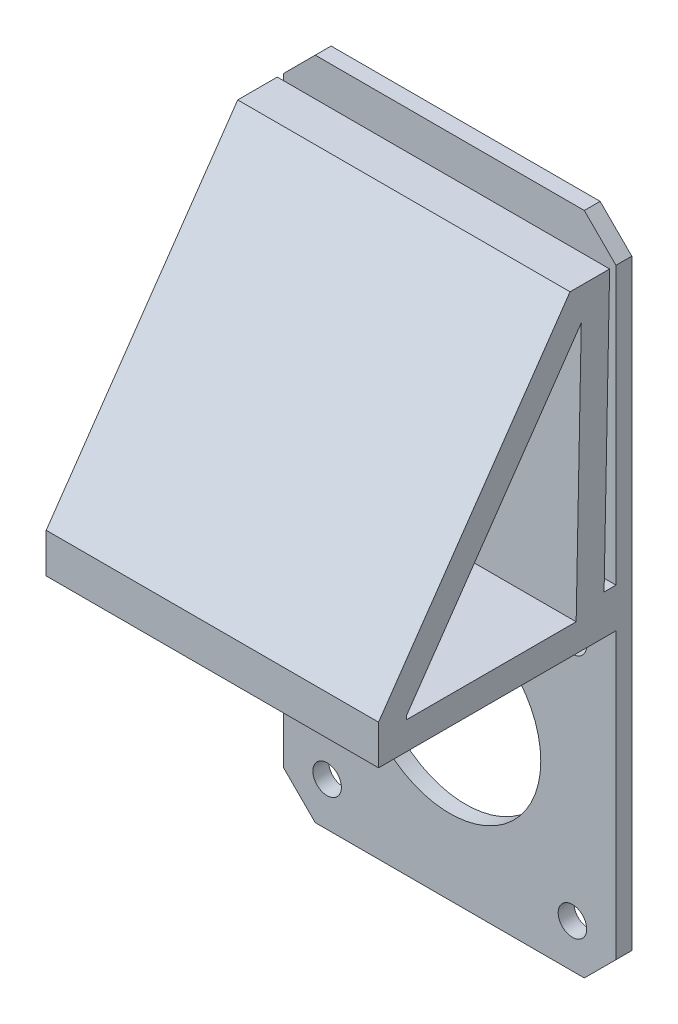
ISO-10303-21;
HEADER;
FILE_DESCRIPTION(('STEP AP214'),'2;1');
FILE_NAME('part.step','',(''),(''),'','','');
FILE_SCHEMA(('AUTOMOTIVE_DESIGN { 1 0 10303 214 1 1 1 1 }'));
ENDSEC;
DATA;
#1=APPLICATION_CONTEXT('core data for automotive mechanical design processes');
#2=APPLICATION_PROTOCOL_DEFINITION('international standard','automotive_design',2000,#1);
#3=PRODUCT_CONTEXT('',#1,'mechanical');
#4=PRODUCT('Part','Part','',(#3));
#5=PRODUCT_RELATED_PRODUCT_CATEGORY('part','',(#4));
#6=PRODUCT_DEFINITION_FORMATION('','',#4);
#7=PRODUCT_DEFINITION_CONTEXT('part definition',#1,'design');
#8=PRODUCT_DEFINITION('design','',#6,#7);
#9=PRODUCT_DEFINITION_SHAPE('','',#8);
#10=(LENGTH_UNIT() NAMED_UNIT(*) SI_UNIT(.MILLI.,.METRE.));
#11=(NAMED_UNIT(*) PLANE_ANGLE_UNIT() SI_UNIT($,.RADIAN.));
#12=(NAMED_UNIT(*) SI_UNIT($,.STERADIAN.) SOLID_ANGLE_UNIT());
#13=UNCERTAINTY_MEASURE_WITH_UNIT(LENGTH_MEASURE(1.E-05),#10,'distance_accuracy_value','');
#14=(GEOMETRIC_REPRESENTATION_CONTEXT(3) GLOBAL_UNCERTAINTY_ASSIGNED_CONTEXT((#13)) GLOBAL_UNIT_ASSIGNED_CONTEXT((#10,
#11,#12)) REPRESENTATION_CONTEXT('',''));
#15=CARTESIAN_POINT('',(0.,0.,0.));
#16=DIRECTION('',(0.,0.,1.));
#17=DIRECTION('',(1.,0.,0.));
#18=AXIS2_PLACEMENT_3D('',#15,#16,#17);
#19=CARTESIAN_POINT('',(0.,0.,2.));
#20=DIRECTION('',(0.,0.,-1.));
#21=DIRECTION('',(-1.,0.,0.));
#22=AXIS2_PLACEMENT_3D('',#19,#20,#21);
#23=PLANE('',#22);
#24=CARTESIAN_POINT('',(-15.5,15.5,2.));
#25=DIRECTION('',(0.,0.,1.));
#26=DIRECTION('',(1.,0.,0.));
#27=AXIS2_PLACEMENT_3D('',#24,#25,#26);
#28=CIRCLE('',#27,1.8);
#29=CARTESIAN_POINT('',(-13.7,15.5,2.));
#30=VERTEX_POINT('',#29);
#31=EDGE_CURVE('E237',#30,#30,#28,.T.);
#32=ORIENTED_EDGE('',*,*,#31,.F.);
#33=EDGE_LOOP('',(#32));
#34=FACE_BOUND('',#33,.T.);
#35=CARTESIAN_POINT('',(15.5,15.5,2.));
#36=DIRECTION('',(0.,0.,1.));
#37=DIRECTION('',(1.,0.,0.));
#38=AXIS2_PLACEMENT_3D('',#35,#36,#37);
#39=CIRCLE('',#38,1.8);
#40=CARTESIAN_POINT('',(17.3,15.5,2.));
#41=VERTEX_POINT('',#40);
#42=EDGE_CURVE('E255',#41,#41,#39,.T.);
#43=ORIENTED_EDGE('',*,*,#42,.F.);
#44=EDGE_LOOP('',(#43));
#45=FACE_BOUND('',#44,.T.);
#46=CARTESIAN_POINT('',(15.5,-15.5,2.));
#47=DIRECTION('',(0.,0.,1.));
#48=DIRECTION('',(1.,0.,0.));
#49=AXIS2_PLACEMENT_3D('',#46,#47,#48);
#50=CIRCLE('',#49,1.8);
#51=CARTESIAN_POINT('',(17.3,-15.5,2.));
#52=VERTEX_POINT('',#51);
#53=EDGE_CURVE('E261',#52,#52,#50,.T.);
#54=ORIENTED_EDGE('',*,*,#53,.F.);
#55=EDGE_LOOP('',(#54));
#56=FACE_BOUND('',#55,.T.);
#57=CARTESIAN_POINT('',(-15.5,-15.5,2.));
#58=DIRECTION('',(0.,0.,1.));
#59=DIRECTION('',(1.,0.,0.));
#60=AXIS2_PLACEMENT_3D('',#57,#58,#59);
#61=CIRCLE('',#60,1.8);
#62=CARTESIAN_POINT('',(-13.7,-15.5,2.));
#63=VERTEX_POINT('',#62);
#64=EDGE_CURVE('E267',#63,#63,#61,.T.);
#65=ORIENTED_EDGE('',*,*,#64,.F.);
#66=EDGE_LOOP('',(#65));
#67=FACE_BOUND('',#66,.T.);
#68=CARTESIAN_POINT('',(0.,0.,2.));
#69=DIRECTION('',(0.,0.,1.));
#70=DIRECTION('',(1.,0.,0.));
#71=AXIS2_PLACEMENT_3D('',#68,#69,#70);
#72=CIRCLE('',#71,11.5);
#73=CARTESIAN_POINT('',(11.5,0.,2.));
#74=VERTEX_POINT('',#73);
#75=EDGE_CURVE('E274',#74,#74,#72,.T.);
#76=ORIENTED_EDGE('',*,*,#75,.F.);
#77=EDGE_LOOP('',(#76));
#78=FACE_BOUND('',#77,.T.);
#79=DIRECTION('',(1.,0.,0.));
#80=VECTOR('',#79,1.);
#81=CARTESIAN_POINT('',(-21.,18.9999999999999,2.));
#82=LINE('',#81,#80);
#83=CARTESIAN_POINT('',(-21.,18.9999999999999,2.));
#84=VERTEX_POINT('',#83);
#85=CARTESIAN_POINT('',(21.,18.9999999999999,2.));
#86=VERTEX_POINT('',#85);
#87=EDGE_CURVE('E235',#84,#86,#82,.T.);
#88=ORIENTED_EDGE('',*,*,#87,.F.);
#89=DIRECTION('',(0.,-1.,0.));
#90=VECTOR('',#89,1.);
#91=CARTESIAN_POINT('',(-21.,-21.,2.));
#92=LINE('',#91,#90);
#93=CARTESIAN_POINT('',(-21.,-17.,2.));
#94=VERTEX_POINT('',#93);
#95=EDGE_CURVE('E284',#84,#94,#92,.T.);
#96=ORIENTED_EDGE('',*,*,#95,.T.);
#97=DIRECTION('',(-0.707106781186545,0.70710678118655,0.));
#98=VECTOR('',#97,1.);
#99=CARTESIAN_POINT('',(-17.,-21.,2.));
#100=LINE('',#99,#98);
#101=CARTESIAN_POINT('',(-17.,-21.,2.));
#102=VERTEX_POINT('',#101);
#103=EDGE_CURVE('E324',#94,#102,#100,.F.);
#104=ORIENTED_EDGE('',*,*,#103,.T.);
#105=DIRECTION('',(1.,0.,0.));
#106=VECTOR('',#105,1.);
#107=CARTESIAN_POINT('',(-21.,-21.,2.));
#108=LINE('',#107,#106);
#109=CARTESIAN_POINT('',(17.,-21.,2.));
#110=VERTEX_POINT('',#109);
#111=EDGE_CURVE('E283',#102,#110,#108,.T.);
#112=ORIENTED_EDGE('',*,*,#111,.T.);
#113=DIRECTION('',(-0.70710678118655,-0.707106781186545,0.));
#114=VECTOR('',#113,1.);
#115=CARTESIAN_POINT('',(21.,-17.,2.));
#116=LINE('',#115,#114);
#117=CARTESIAN_POINT('',(21.,-17.,2.));
#118=VERTEX_POINT('',#117);
#119=EDGE_CURVE('E326',#110,#118,#116,.F.);
#120=ORIENTED_EDGE('',*,*,#119,.T.);
#121=DIRECTION('',(0.,1.,0.));
#122=VECTOR('',#121,1.);
#123=CARTESIAN_POINT('',(21.,-21.,2.));
#124=LINE('',#123,#122);
#125=EDGE_CURVE('E288',#118,#86,#124,.T.);
#126=ORIENTED_EDGE('',*,*,#125,.T.);
#127=EDGE_LOOP('',(#88,#96,#104,#112,#120,#126));
#128=FACE_BOUND('',#127,.T.);
#129=ADVANCED_FACE('F33',(#34,#45,#56,#67,#78,#128),#23,.F.);
#130=CARTESIAN_POINT('',(-21.,59.,2.));
#131=VERTEX_POINT('',#130);
#132=CARTESIAN_POINT('',(-21.,23.9999999999999,2.));
#133=VERTEX_POINT('',#132);
#134=EDGE_CURVE('E280',#131,#133,#92,.T.);
#135=ORIENTED_EDGE('',*,*,#134,.T.);
#136=DIRECTION('',(1.,0.,0.));
#137=VECTOR('',#136,1.);
#138=CARTESIAN_POINT('',(-21.,23.9999999999999,2.));
#139=LINE('',#138,#137);
#140=CARTESIAN_POINT('',(21.,23.9999999999999,2.));
#141=VERTEX_POINT('',#140);
#142=EDGE_CURVE('E218',#133,#141,#139,.T.);
#143=ORIENTED_EDGE('',*,*,#142,.T.);
#144=CARTESIAN_POINT('',(21.,58.9999999999999,2.));
#145=VERTEX_POINT('',#144);
#146=EDGE_CURVE('E287',#141,#145,#124,.T.);
#147=ORIENTED_EDGE('',*,*,#146,.T.);
#148=DIRECTION('',(0.707106781186545,-0.70710678118655,0.));
#149=VECTOR('',#148,1.);
#150=CARTESIAN_POINT('',(17.,63.,2.));
#151=LINE('',#150,#149);
#152=CARTESIAN_POINT('',(17.,63.,2.));
#153=VERTEX_POINT('',#152);
#154=EDGE_CURVE('E328',#145,#153,#151,.F.);
#155=ORIENTED_EDGE('',*,*,#154,.T.);
#156=DIRECTION('',(-1.,0.,0.));
#157=VECTOR('',#156,1.);
#158=CARTESIAN_POINT('',(-21.,63.,2.));
#159=LINE('',#158,#157);
#160=CARTESIAN_POINT('',(-17.,63.,2.));
#161=VERTEX_POINT('',#160);
#162=EDGE_CURVE('E291',#153,#161,#159,.T.);
#163=ORIENTED_EDGE('',*,*,#162,.T.);
#164=DIRECTION('',(0.70710678118655,0.707106781186545,0.));
#165=VECTOR('',#164,1.);
#166=CARTESIAN_POINT('',(-21.,59.,2.));
#167=LINE('',#166,#165);
#168=EDGE_CURVE('E330',#161,#131,#167,.F.);
#169=ORIENTED_EDGE('',*,*,#168,.T.);
#170=EDGE_LOOP('',(#135,#143,#147,#155,#163,#169));
#171=FACE_BOUND('',#170,.T.);
#172=ADVANCED_FACE('F377',(#171),#23,.F.);
#173=CARTESIAN_POINT('',(0.,0.,0.));
#174=DIRECTION('',(0.,0.,-1.));
#175=DIRECTION('',(-1.,0.,0.));
#176=AXIS2_PLACEMENT_3D('',#173,#174,#175);
#177=PLANE('',#176);
#178=CARTESIAN_POINT('',(-15.5,15.5,0.));
#179=DIRECTION('',(0.,0.,1.));
#180=DIRECTION('',(1.,0.,0.));
#181=AXIS2_PLACEMENT_3D('',#178,#179,#180);
#182=CIRCLE('',#181,1.8);
#183=CARTESIAN_POINT('',(-13.7,15.5,0.));
#184=VERTEX_POINT('',#183);
#185=EDGE_CURVE('E252',#184,#184,#182,.T.);
#186=ORIENTED_EDGE('',*,*,#185,.T.);
#187=EDGE_LOOP('',(#186));
#188=FACE_BOUND('',#187,.T.);
#189=CARTESIAN_POINT('',(15.5,15.5,0.));
#190=DIRECTION('',(0.,0.,1.));
#191=DIRECTION('',(1.,0.,0.));
#192=AXIS2_PLACEMENT_3D('',#189,#190,#191);
#193=CIRCLE('',#192,1.8);
#194=CARTESIAN_POINT('',(17.3,15.5,0.));
#195=VERTEX_POINT('',#194);
#196=EDGE_CURVE('E258',#195,#195,#193,.T.);
#197=ORIENTED_EDGE('',*,*,#196,.T.);
#198=EDGE_LOOP('',(#197));
#199=FACE_BOUND('',#198,.T.);
#200=CARTESIAN_POINT('',(15.5,-15.5,0.));
#201=DIRECTION('',(0.,0.,1.));
#202=DIRECTION('',(1.,0.,0.));
#203=AXIS2_PLACEMENT_3D('',#200,#201,#202);
#204=CIRCLE('',#203,1.8);
#205=CARTESIAN_POINT('',(17.3,-15.5,0.));
#206=VERTEX_POINT('',#205);
#207=EDGE_CURVE('E264',#206,#206,#204,.T.);
#208=ORIENTED_EDGE('',*,*,#207,.T.);
#209=EDGE_LOOP('',(#208));
#210=FACE_BOUND('',#209,.T.);
#211=CARTESIAN_POINT('',(-15.5,-15.5,0.));
#212=DIRECTION('',(0.,0.,1.));
#213=DIRECTION('',(1.,0.,0.));
#214=AXIS2_PLACEMENT_3D('',#211,#212,#213);
#215=CIRCLE('',#214,1.8);
#216=CARTESIAN_POINT('',(-13.7,-15.5,0.));
#217=VERTEX_POINT('',#216);
#218=EDGE_CURVE('E270',#217,#217,#215,.T.);
#219=ORIENTED_EDGE('',*,*,#218,.T.);
#220=EDGE_LOOP('',(#219));
#221=FACE_BOUND('',#220,.T.);
#222=DIRECTION('',(0.,-1.,0.));
#223=VECTOR('',#222,1.);
#224=CARTESIAN_POINT('',(-21.,-21.,0.));
#225=LINE('',#224,#223);
#226=CARTESIAN_POINT('',(-21.,59.,0.));
#227=VERTEX_POINT('',#226);
#228=CARTESIAN_POINT('',(-21.,-17.,0.));
#229=VERTEX_POINT('',#228);
#230=EDGE_CURVE('E277',#227,#229,#225,.T.);
#231=ORIENTED_EDGE('',*,*,#230,.F.);
#232=DIRECTION('',(-0.70710678118655,-0.707106781186545,0.));
#233=VECTOR('',#232,1.);
#234=CARTESIAN_POINT('',(-39.9999999999999,40.0000000000002,0.));
#235=LINE('',#234,#233);
#236=CARTESIAN_POINT('',(-17.,63.,0.));
#237=VERTEX_POINT('',#236);
#238=EDGE_CURVE('E317',#227,#237,#235,.F.);
#239=ORIENTED_EDGE('',*,*,#238,.T.);
#240=DIRECTION('',(-1.,0.,0.));
#241=VECTOR('',#240,1.);
#242=CARTESIAN_POINT('',(-21.,63.,0.));
#243=LINE('',#242,#241);
#244=CARTESIAN_POINT('',(17.,63.,0.));
#245=VERTEX_POINT('',#244);
#246=EDGE_CURVE('E303',#245,#237,#243,.T.);
#247=ORIENTED_EDGE('',*,*,#246,.F.);
#248=DIRECTION('',(-0.707106781186545,0.70710678118655,0.));
#249=VECTOR('',#248,1.);
#250=CARTESIAN_POINT('',(40.0000000000001,39.9999999999998,0.));
#251=LINE('',#250,#249);
#252=CARTESIAN_POINT('',(21.,58.9999999999999,0.));
#253=VERTEX_POINT('',#252);
#254=EDGE_CURVE('E315',#245,#253,#251,.F.);
#255=ORIENTED_EDGE('',*,*,#254,.T.);
#256=DIRECTION('',(0.,1.,0.));
#257=VECTOR('',#256,1.);
#258=CARTESIAN_POINT('',(21.,-21.,0.));
#259=LINE('',#258,#257);
#260=CARTESIAN_POINT('',(21.,-17.,0.));
#261=VERTEX_POINT('',#260);
#262=EDGE_CURVE('E300',#261,#253,#259,.T.);
#263=ORIENTED_EDGE('',*,*,#262,.F.);
#264=DIRECTION('',(0.70710678118655,0.707106781186545,0.));
#265=VECTOR('',#264,1.);
#266=CARTESIAN_POINT('',(18.9999999999999,-19.0000000000001,0.));
#267=LINE('',#266,#265);
#268=CARTESIAN_POINT('',(17.,-21.,0.));
#269=VERTEX_POINT('',#268);
#270=EDGE_CURVE('E313',#261,#269,#267,.F.);
#271=ORIENTED_EDGE('',*,*,#270,.T.);
#272=DIRECTION('',(1.,0.,0.));
#273=VECTOR('',#272,1.);
#274=CARTESIAN_POINT('',(-21.,-21.,0.));
#275=LINE('',#274,#273);
#276=CARTESIAN_POINT('',(-17.,-21.,0.));
#277=VERTEX_POINT('',#276);
#278=EDGE_CURVE('E297',#277,#269,#275,.T.);
#279=ORIENTED_EDGE('',*,*,#278,.F.);
#280=DIRECTION('',(0.707106781186545,-0.70710678118655,0.));
#281=VECTOR('',#280,1.);
#282=CARTESIAN_POINT('',(-19.0000000000001,-18.9999999999999,0.));
#283=LINE('',#282,#281);
#284=EDGE_CURVE('E311',#277,#229,#283,.F.);
#285=ORIENTED_EDGE('',*,*,#284,.T.);
#286=EDGE_LOOP('',(#231,#239,#247,#255,#263,#271,#279,#285));
#287=FACE_BOUND('',#286,.T.);
#288=CARTESIAN_POINT('',(0.,0.,0.));
#289=DIRECTION('',(0.,0.,1.));
#290=DIRECTION('',(1.,0.,0.));
#291=AXIS2_PLACEMENT_3D('',#288,#289,#290);
#292=CIRCLE('',#291,11.5);
#293=CARTESIAN_POINT('',(11.5,0.,0.));
#294=VERTEX_POINT('',#293);
#295=EDGE_CURVE('E273',#294,#294,#292,.T.);
#296=ORIENTED_EDGE('',*,*,#295,.T.);
#297=EDGE_LOOP('',(#296));
#298=FACE_BOUND('',#297,.T.);
#299=ADVANCED_FACE('F348',(#188,#199,#210,#221,#287,#298),#177,.T.);
#300=CARTESIAN_POINT('',(-21.,-21.,2.));
#301=DIRECTION('',(1.,0.,0.));
#302=DIRECTION('',(0.,1.,0.));
#303=AXIS2_PLACEMENT_3D('',#300,#301,#302);
#304=PLANE('',#303);
#305=DIRECTION('',(0.,0.,1.));
#306=VECTOR('',#305,1.);
#307=CARTESIAN_POINT('',(-21.,22.4999999999999,7.03069993001399));
#308=LINE('',#307,#306);
#309=CARTESIAN_POINT('',(-21.,22.4999999999999,7.03069993001399));
#310=VERTEX_POINT('',#309);
#311=CARTESIAN_POINT('',(-21.,22.4999999999999,28.5));
#312=VERTEX_POINT('',#311);
#313=EDGE_CURVE('E190',#310,#312,#308,.T.);
#314=ORIENTED_EDGE('',*,*,#313,.F.);
#315=DIRECTION('',(0.,-0.999800059980007,0.0199960011995999));
#316=VECTOR('',#315,1.);
#317=CARTESIAN_POINT('',(-21.,54.8955254232018,6.38278942154996));
#318=LINE('',#317,#316);
#319=CARTESIAN_POINT('',(-21.,54.8955254232018,6.38278942154996));
#320=VERTEX_POINT('',#319);
#321=EDGE_CURVE('E48',#320,#310,#318,.T.);
#322=ORIENTED_EDGE('',*,*,#321,.F.);
#323=DIRECTION('',(0.,0.822530458866848,-0.568721060130792));
#324=VECTOR('',#323,1.);
#325=CARTESIAN_POINT('',(-21.,22.9078241733773,28.5));
#326=LINE('',#325,#324);
#327=CARTESIAN_POINT('',(-21.,22.9078241733773,28.5));
#328=VERTEX_POINT('',#327);
#329=EDGE_CURVE('E181',#328,#320,#326,.T.);
#330=ORIENTED_EDGE('',*,*,#329,.F.);
#331=DIRECTION('',(0.,1.,0.));
#332=VECTOR('',#331,1.);
#333=CARTESIAN_POINT('',(-21.,22.4999999999999,28.5));
#334=LINE('',#333,#332);
#335=EDGE_CURVE('E184',#312,#328,#334,.T.);
#336=ORIENTED_EDGE('',*,*,#335,.F.);
#337=EDGE_LOOP('',(#314,#322,#330,#336));
#338=FACE_BOUND('',#337,.T.);
#339=ORIENTED_EDGE('',*,*,#134,.F.);
#340=DIRECTION('',(0.,0.,-1.));
#341=VECTOR('',#340,1.);
#342=CARTESIAN_POINT('',(-21.,59.,2.));
#343=LINE('',#342,#341);
#344=EDGE_CURVE('E308',#131,#227,#343,.T.);
#345=ORIENTED_EDGE('',*,*,#344,.T.);
#346=ORIENTED_EDGE('',*,*,#230,.T.);
#347=DIRECTION('',(0.,0.,1.));
#348=VECTOR('',#347,1.);
#349=CARTESIAN_POINT('',(-21.,-17.,2.));
#350=LINE('',#349,#348);
#351=EDGE_CURVE('E294',#229,#94,#350,.T.);
#352=ORIENTED_EDGE('',*,*,#351,.T.);
#353=ORIENTED_EDGE('',*,*,#95,.F.);
#354=DIRECTION('',(0.,0.,-1.));
#355=VECTOR('',#354,1.);
#356=CARTESIAN_POINT('',(-21.,18.9999999999999,2.));
#357=LINE('',#356,#355);
#358=CARTESIAN_POINT('',(-21.,18.9999999999999,32.));
#359=VERTEX_POINT('',#358);
#360=EDGE_CURVE('E216',#359,#84,#357,.T.);
#361=ORIENTED_EDGE('',*,*,#360,.F.);
#362=DIRECTION('',(0.,-1.,0.));
#363=VECTOR('',#362,1.);
#364=CARTESIAN_POINT('',(-21.,23.9999999999999,32.));
#365=LINE('',#364,#363);
#366=CARTESIAN_POINT('',(-21.,23.9999999999999,32.));
#367=VERTEX_POINT('',#366);
#368=EDGE_CURVE('E213',#367,#359,#365,.T.);
#369=ORIENTED_EDGE('',*,*,#368,.F.);
#370=DIRECTION('',(0.,-0.822530458866848,0.568721060130792));
#371=VECTOR('',#370,1.);
#372=CARTESIAN_POINT('',(-21.,23.9999999999999,32.));
#373=LINE('',#372,#371);
#374=CARTESIAN_POINT('',(-21.,58.9999999999999,7.8));
#375=VERTEX_POINT('',#374);
#376=EDGE_CURVE('E210',#375,#367,#373,.T.);
#377=ORIENTED_EDGE('',*,*,#376,.F.);
#378=DIRECTION('',(0.,0.,1.));
#379=VECTOR('',#378,1.);
#380=CARTESIAN_POINT('',(-21.,58.9999999999999,7.8));
#381=LINE('',#380,#379);
#382=CARTESIAN_POINT('',(-21.,58.9999999999999,2.8));
#383=VERTEX_POINT('',#382);
#384=EDGE_CURVE('E207',#383,#375,#381,.T.);
#385=ORIENTED_EDGE('',*,*,#384,.F.);
#386=DIRECTION('',(0.,0.999800059980007,-0.0199960011996));
#387=VECTOR('',#386,1.);
#388=CARTESIAN_POINT('',(-21.,58.9999999999999,2.8));
#389=LINE('',#388,#387);
#390=CARTESIAN_POINT('',(-21.,23.9999999999999,3.5));
#391=VERTEX_POINT('',#390);
#392=EDGE_CURVE('E203',#391,#383,#389,.T.);
#393=ORIENTED_EDGE('',*,*,#392,.F.);
#394=DIRECTION('',(0.,0.,1.));
#395=VECTOR('',#394,1.);
#396=CARTESIAN_POINT('',(-21.,23.9999999999999,2.));
#397=LINE('',#396,#395);
#398=EDGE_CURVE('E200',#133,#391,#397,.T.);
#399=ORIENTED_EDGE('',*,*,#398,.F.);
#400=EDGE_LOOP('',(#339,#345,#346,#352,#353,#361,#369,#377,#385,#393,#399));
#401=FACE_BOUND('',#400,.T.);
#402=ADVANCED_FACE('F364',(#338,#401),#304,.F.);
#403=CARTESIAN_POINT('',(-21.,-21.,2.));
#404=DIRECTION('',(0.,1.,0.));
#405=DIRECTION('',(-1.,0.,0.));
#406=AXIS2_PLACEMENT_3D('',#403,#404,#405);
#407=PLANE('',#406);
#408=ORIENTED_EDGE('',*,*,#278,.T.);
#409=DIRECTION('',(0.,0.,1.));
#410=VECTOR('',#409,1.);
#411=CARTESIAN_POINT('',(17.,-21.,2.));
#412=LINE('',#411,#410);
#413=EDGE_CURVE('E11',#269,#110,#412,.T.);
#414=ORIENTED_EDGE('',*,*,#413,.T.);
#415=ORIENTED_EDGE('',*,*,#111,.F.);
#416=DIRECTION('',(0.,0.,-1.));
#417=VECTOR('',#416,1.);
#418=CARTESIAN_POINT('',(-17.,-21.,2.));
#419=LINE('',#418,#417);
#420=EDGE_CURVE('E41',#102,#277,#419,.T.);
#421=ORIENTED_EDGE('',*,*,#420,.T.);
#422=EDGE_LOOP('',(#408,#414,#415,#421));
#423=FACE_BOUND('',#422,.T.);
#424=ADVANCED_FACE('F342',(#423),#407,.F.);
#425=CARTESIAN_POINT('',(21.,-21.,2.));
#426=DIRECTION('',(-1.,0.,0.));
#427=DIRECTION('',(0.,0.,1.));
#428=AXIS2_PLACEMENT_3D('',#425,#426,#427);
#429=PLANE('',#428);
#430=DIRECTION('',(0.,0.822530458866848,-0.568721060130792));
#431=VECTOR('',#430,1.);
#432=CARTESIAN_POINT('',(21.,22.9078241733773,28.5));
#433=LINE('',#432,#431);
#434=CARTESIAN_POINT('',(21.,22.9078241733773,28.5));
#435=VERTEX_POINT('',#434);
#436=CARTESIAN_POINT('',(21.,54.8955254232018,6.38278942154996));
#437=VERTEX_POINT('',#436);
#438=EDGE_CURVE('E171',#435,#437,#433,.T.);
#439=ORIENTED_EDGE('',*,*,#438,.T.);
#440=DIRECTION('',(0.,-0.999800059980007,0.0199960011995999));
#441=VECTOR('',#440,1.);
#442=CARTESIAN_POINT('',(21.,54.8955254232018,6.38278942154996));
#443=LINE('',#442,#441);
#444=CARTESIAN_POINT('',(21.,22.4999999999999,7.03069993001399));
#445=VERTEX_POINT('',#444);
#446=EDGE_CURVE('E165',#437,#445,#443,.T.);
#447=ORIENTED_EDGE('',*,*,#446,.T.);
#448=DIRECTION('',(0.,0.,1.));
#449=VECTOR('',#448,1.);
#450=CARTESIAN_POINT('',(21.,22.4999999999999,7.03069993001399));
#451=LINE('',#450,#449);
#452=CARTESIAN_POINT('',(21.,22.4999999999999,28.5));
#453=VERTEX_POINT('',#452);
#454=EDGE_CURVE('E174',#445,#453,#451,.T.);
#455=ORIENTED_EDGE('',*,*,#454,.T.);
#456=DIRECTION('',(0.,1.,0.));
#457=VECTOR('',#456,1.);
#458=CARTESIAN_POINT('',(21.,22.4999999999999,28.5));
#459=LINE('',#458,#457);
#460=EDGE_CURVE('E56',#453,#435,#459,.T.);
#461=ORIENTED_EDGE('',*,*,#460,.T.);
#462=EDGE_LOOP('',(#439,#447,#455,#461));
#463=FACE_BOUND('',#462,.T.);
#464=ORIENTED_EDGE('',*,*,#262,.T.);
#465=DIRECTION('',(0.,0.,1.));
#466=VECTOR('',#465,1.);
#467=CARTESIAN_POINT('',(21.,59.,2.));
#468=LINE('',#467,#466);
#469=EDGE_CURVE('E335',#253,#145,#468,.T.);
#470=ORIENTED_EDGE('',*,*,#469,.T.);
#471=ORIENTED_EDGE('',*,*,#146,.F.);
#472=DIRECTION('',(0.,0.,1.));
#473=VECTOR('',#472,1.);
#474=CARTESIAN_POINT('',(21.,23.9999999999999,2.));
#475=LINE('',#474,#473);
#476=CARTESIAN_POINT('',(21.,23.9999999999999,3.5));
#477=VERTEX_POINT('',#476);
#478=EDGE_CURVE('E196',#141,#477,#475,.T.);
#479=ORIENTED_EDGE('',*,*,#478,.T.);
#480=DIRECTION('',(0.,0.999800059980007,-0.0199960011996));
#481=VECTOR('',#480,1.);
#482=CARTESIAN_POINT('',(21.,58.9999999999999,2.8));
#483=LINE('',#482,#481);
#484=CARTESIAN_POINT('',(21.,58.9999999999999,2.8));
#485=VERTEX_POINT('',#484);
#486=EDGE_CURVE('E221',#477,#485,#483,.T.);
#487=ORIENTED_EDGE('',*,*,#486,.T.);
#488=DIRECTION('',(0.,0.,1.));
#489=VECTOR('',#488,1.);
#490=CARTESIAN_POINT('',(21.,58.9999999999999,7.8));
#491=LINE('',#490,#489);
#492=CARTESIAN_POINT('',(21.,58.9999999999999,7.8));
#493=VERTEX_POINT('',#492);
#494=EDGE_CURVE('E224',#485,#493,#491,.T.);
#495=ORIENTED_EDGE('',*,*,#494,.T.);
#496=DIRECTION('',(0.,-0.822530458866848,0.568721060130792));
#497=VECTOR('',#496,1.);
#498=CARTESIAN_POINT('',(21.,23.9999999999999,32.));
#499=LINE('',#498,#497);
#500=CARTESIAN_POINT('',(21.,23.9999999999999,32.));
#501=VERTEX_POINT('',#500);
#502=EDGE_CURVE('E227',#493,#501,#499,.T.);
#503=ORIENTED_EDGE('',*,*,#502,.T.);
#504=DIRECTION('',(0.,-1.,0.));
#505=VECTOR('',#504,1.);
#506=CARTESIAN_POINT('',(21.,23.9999999999999,32.));
#507=LINE('',#506,#505);
#508=CARTESIAN_POINT('',(21.,18.9999999999999,32.));
#509=VERTEX_POINT('',#508);
#510=EDGE_CURVE('E230',#501,#509,#507,.T.);
#511=ORIENTED_EDGE('',*,*,#510,.T.);
#512=DIRECTION('',(0.,0.,-1.));
#513=VECTOR('',#512,1.);
#514=CARTESIAN_POINT('',(21.,18.9999999999999,2.));
#515=LINE('',#514,#513);
#516=EDGE_CURVE('E204',#509,#86,#515,.T.);
#517=ORIENTED_EDGE('',*,*,#516,.T.);
#518=ORIENTED_EDGE('',*,*,#125,.F.);
#519=DIRECTION('',(0.,0.,-1.));
#520=VECTOR('',#519,1.);
#521=CARTESIAN_POINT('',(21.,-17.,2.));
#522=LINE('',#521,#520);
#523=EDGE_CURVE('E332',#118,#261,#522,.T.);
#524=ORIENTED_EDGE('',*,*,#523,.T.);
#525=EDGE_LOOP('',(#464,#470,#471,#479,#487,#495,#503,#511,#517,#518,#524));
#526=FACE_BOUND('',#525,.T.);
#527=ADVANCED_FACE('F178',(#463,#526),#429,.F.);
#528=CARTESIAN_POINT('',(-21.,63.,2.));
#529=DIRECTION('',(0.,-1.,0.));
#530=DIRECTION('',(0.,0.,-1.));
#531=AXIS2_PLACEMENT_3D('',#528,#529,#530);
#532=PLANE('',#531);
#533=ORIENTED_EDGE('',*,*,#246,.T.);
#534=DIRECTION('',(0.,0.,1.));
#535=VECTOR('',#534,1.);
#536=CARTESIAN_POINT('',(-17.,63.,2.));
#537=LINE('',#536,#535);
#538=EDGE_CURVE('E322',#237,#161,#537,.T.);
#539=ORIENTED_EDGE('',*,*,#538,.T.);
#540=ORIENTED_EDGE('',*,*,#162,.F.);
#541=DIRECTION('',(0.,0.,-1.));
#542=VECTOR('',#541,1.);
#543=CARTESIAN_POINT('',(17.,63.,2.));
#544=LINE('',#543,#542);
#545=EDGE_CURVE('E319',#153,#245,#544,.T.);
#546=ORIENTED_EDGE('',*,*,#545,.T.);
#547=EDGE_LOOP('',(#533,#539,#540,#546));
#548=FACE_BOUND('',#547,.T.);
#549=ADVANCED_FACE('F371',(#548),#532,.F.);
#550=CARTESIAN_POINT('',(0.,0.,2.));
#551=DIRECTION('',(0.,0.,-1.));
#552=DIRECTION('',(-1.,0.,0.));
#553=AXIS2_PLACEMENT_3D('',#550,#551,#552);
#554=CYLINDRICAL_SURFACE('',#553,11.5);
#555=ORIENTED_EDGE('',*,*,#75,.T.);
#556=EDGE_LOOP('',(#555));
#557=FACE_BOUND('',#556,.T.);
#558=ORIENTED_EDGE('',*,*,#295,.F.);
#559=EDGE_LOOP('',(#558));
#560=FACE_BOUND('',#559,.T.);
#561=ADVANCED_FACE('F407',(#557,#560),#554,.F.);
#562=CARTESIAN_POINT('',(-15.5,-15.5,2.));
#563=DIRECTION('',(0.,0.,1.));
#564=DIRECTION('',(1.,0.,0.));
#565=AXIS2_PLACEMENT_3D('',#562,#563,#564);
#566=CYLINDRICAL_SURFACE('',#565,1.8);
#567=ORIENTED_EDGE('',*,*,#218,.F.);
#568=EDGE_LOOP('',(#567));
#569=FACE_BOUND('',#568,.T.);
#570=ORIENTED_EDGE('',*,*,#64,.T.);
#571=EDGE_LOOP('',(#570));
#572=FACE_BOUND('',#571,.T.);
#573=ADVANCED_FACE('F469',(#569,#572),#566,.F.);
#574=CARTESIAN_POINT('',(15.5,-15.5,2.));
#575=DIRECTION('',(0.,0.,1.));
#576=DIRECTION('',(1.,0.,0.));
#577=AXIS2_PLACEMENT_3D('',#574,#575,#576);
#578=CYLINDRICAL_SURFACE('',#577,1.8);
#579=ORIENTED_EDGE('',*,*,#207,.F.);
#580=EDGE_LOOP('',(#579));
#581=FACE_BOUND('',#580,.T.);
#582=ORIENTED_EDGE('',*,*,#53,.T.);
#583=EDGE_LOOP('',(#582));
#584=FACE_BOUND('',#583,.T.);
#585=ADVANCED_FACE('F466',(#581,#584),#578,.F.);
#586=CARTESIAN_POINT('',(15.5,15.5,2.));
#587=DIRECTION('',(0.,0.,1.));
#588=DIRECTION('',(1.,0.,0.));
#589=AXIS2_PLACEMENT_3D('',#586,#587,#588);
#590=CYLINDRICAL_SURFACE('',#589,1.8);
#591=ORIENTED_EDGE('',*,*,#196,.F.);
#592=EDGE_LOOP('',(#591));
#593=FACE_BOUND('',#592,.T.);
#594=ORIENTED_EDGE('',*,*,#42,.T.);
#595=EDGE_LOOP('',(#594));
#596=FACE_BOUND('',#595,.T.);
#597=ADVANCED_FACE('F462',(#593,#596),#590,.F.);
#598=CARTESIAN_POINT('',(-15.5,15.5,2.));
#599=DIRECTION('',(0.,0.,1.));
#600=DIRECTION('',(1.,0.,0.));
#601=AXIS2_PLACEMENT_3D('',#598,#599,#600);
#602=CYLINDRICAL_SURFACE('',#601,1.8);
#603=ORIENTED_EDGE('',*,*,#185,.F.);
#604=EDGE_LOOP('',(#603));
#605=FACE_BOUND('',#604,.T.);
#606=ORIENTED_EDGE('',*,*,#31,.T.);
#607=EDGE_LOOP('',(#606));
#608=FACE_BOUND('',#607,.T.);
#609=ADVANCED_FACE('F394',(#605,#608),#602,.F.);
#610=CARTESIAN_POINT('',(-21.,59.,2.));
#611=DIRECTION('',(0.707106781186545,-0.70710678118655,0.));
#612=DIRECTION('',(0.,0.,-1.));
#613=AXIS2_PLACEMENT_3D('',#610,#611,#612);
#614=PLANE('',#613);
#615=ORIENTED_EDGE('',*,*,#168,.F.);
#616=ORIENTED_EDGE('',*,*,#538,.F.);
#617=ORIENTED_EDGE('',*,*,#238,.F.);
#618=ORIENTED_EDGE('',*,*,#344,.F.);
#619=EDGE_LOOP('',(#615,#616,#617,#618));
#620=FACE_BOUND('',#619,.T.);
#621=ADVANCED_FACE('F375',(#620),#614,.F.);
#622=CARTESIAN_POINT('',(17.,63.,2.));
#623=DIRECTION('',(-0.70710678118655,-0.707106781186545,0.));
#624=DIRECTION('',(0.,0.,-1.));
#625=AXIS2_PLACEMENT_3D('',#622,#623,#624);
#626=PLANE('',#625);
#627=ORIENTED_EDGE('',*,*,#154,.F.);
#628=ORIENTED_EDGE('',*,*,#469,.F.);
#629=ORIENTED_EDGE('',*,*,#254,.F.);
#630=ORIENTED_EDGE('',*,*,#545,.F.);
#631=EDGE_LOOP('',(#627,#628,#629,#630));
#632=FACE_BOUND('',#631,.T.);
#633=ADVANCED_FACE('F387',(#632),#626,.F.);
#634=CARTESIAN_POINT('',(21.,-17.,2.));
#635=DIRECTION('',(-0.707106781186545,0.70710678118655,0.));
#636=DIRECTION('',(0.,0.,-1.));
#637=AXIS2_PLACEMENT_3D('',#634,#635,#636);
#638=PLANE('',#637);
#639=ORIENTED_EDGE('',*,*,#119,.F.);
#640=ORIENTED_EDGE('',*,*,#413,.F.);
#641=ORIENTED_EDGE('',*,*,#270,.F.);
#642=ORIENTED_EDGE('',*,*,#523,.F.);
#643=EDGE_LOOP('',(#639,#640,#641,#642));
#644=FACE_BOUND('',#643,.T.);
#645=ADVANCED_FACE('F354',(#644),#638,.F.);
#646=CARTESIAN_POINT('',(-17.,-21.,2.));
#647=DIRECTION('',(0.70710678118655,0.707106781186545,0.));
#648=DIRECTION('',(0.,0.,-1.));
#649=AXIS2_PLACEMENT_3D('',#646,#647,#648);
#650=PLANE('',#649);
#651=ORIENTED_EDGE('',*,*,#103,.F.);
#652=ORIENTED_EDGE('',*,*,#351,.F.);
#653=ORIENTED_EDGE('',*,*,#284,.F.);
#654=ORIENTED_EDGE('',*,*,#420,.F.);
#655=EDGE_LOOP('',(#651,#652,#653,#654));
#656=FACE_BOUND('',#655,.T.);
#657=ADVANCED_FACE('F35',(#656),#650,.F.);
#658=CARTESIAN_POINT('',(-21.,18.9999999999999,2.));
#659=DIRECTION('',(0.,-1.,0.));
#660=DIRECTION('',(0.,0.,-1.));
#661=AXIS2_PLACEMENT_3D('',#658,#659,#660);
#662=PLANE('',#661);
#663=ORIENTED_EDGE('',*,*,#516,.F.);
#664=DIRECTION('',(1.,0.,0.));
#665=VECTOR('',#664,1.);
#666=CARTESIAN_POINT('',(-21.,18.9999999999999,32.));
#667=LINE('',#666,#665);
#668=EDGE_CURVE('E238',#359,#509,#667,.T.);
#669=ORIENTED_EDGE('',*,*,#668,.F.);
#670=ORIENTED_EDGE('',*,*,#360,.T.);
#671=ORIENTED_EDGE('',*,*,#87,.T.);
#672=EDGE_LOOP('',(#663,#669,#670,#671));
#673=FACE_BOUND('',#672,.T.);
#674=ADVANCED_FACE('F438',(#673),#662,.T.);
#675=CARTESIAN_POINT('',(-21.,23.9999999999999,32.));
#676=DIRECTION('',(0.,0.,1.));
#677=DIRECTION('',(1.,0.,0.));
#678=AXIS2_PLACEMENT_3D('',#675,#676,#677);
#679=PLANE('',#678);
#680=ORIENTED_EDGE('',*,*,#510,.F.);
#681=DIRECTION('',(1.,0.,0.));
#682=VECTOR('',#681,1.);
#683=CARTESIAN_POINT('',(-21.,23.9999999999999,32.));
#684=LINE('',#683,#682);
#685=EDGE_CURVE('E240',#367,#501,#684,.T.);
#686=ORIENTED_EDGE('',*,*,#685,.F.);
#687=ORIENTED_EDGE('',*,*,#368,.T.);
#688=ORIENTED_EDGE('',*,*,#668,.T.);
#689=EDGE_LOOP('',(#680,#686,#687,#688));
#690=FACE_BOUND('',#689,.T.);
#691=ADVANCED_FACE('F441',(#690),#679,.T.);
#692=CARTESIAN_POINT('',(-21.,23.9999999999999,32.));
#693=DIRECTION('',(0.,0.568721060130792,0.822530458866848));
#694=DIRECTION('',(0.,-0.822530458866848,0.568721060130792));
#695=AXIS2_PLACEMENT_3D('',#692,#693,#694);
#696=PLANE('',#695);
#697=ORIENTED_EDGE('',*,*,#502,.F.);
#698=DIRECTION('',(1.,0.,0.));
#699=VECTOR('',#698,1.);
#700=CARTESIAN_POINT('',(-21.,58.9999999999999,7.8));
#701=LINE('',#700,#699);
#702=EDGE_CURVE('E242',#375,#493,#701,.T.);
#703=ORIENTED_EDGE('',*,*,#702,.F.);
#704=ORIENTED_EDGE('',*,*,#376,.T.);
#705=ORIENTED_EDGE('',*,*,#685,.T.);
#706=EDGE_LOOP('',(#697,#703,#704,#705));
#707=FACE_BOUND('',#706,.T.);
#708=ADVANCED_FACE('F445',(#707),#696,.T.);
#709=CARTESIAN_POINT('',(-21.,58.9999999999999,7.8));
#710=DIRECTION('',(0.,1.,0.));
#711=DIRECTION('',(0.,0.,1.));
#712=AXIS2_PLACEMENT_3D('',#709,#710,#711);
#713=PLANE('',#712);
#714=ORIENTED_EDGE('',*,*,#494,.F.);
#715=DIRECTION('',(1.,0.,0.));
#716=VECTOR('',#715,1.);
#717=CARTESIAN_POINT('',(-21.,58.9999999999999,2.8));
#718=LINE('',#717,#716);
#719=EDGE_CURVE('E244',#383,#485,#718,.T.);
#720=ORIENTED_EDGE('',*,*,#719,.F.);
#721=ORIENTED_EDGE('',*,*,#384,.T.);
#722=ORIENTED_EDGE('',*,*,#702,.T.);
#723=EDGE_LOOP('',(#714,#720,#721,#722));
#724=FACE_BOUND('',#723,.T.);
#725=ADVANCED_FACE('F449',(#724),#713,.T.);
#726=CARTESIAN_POINT('',(-21.,58.9999999999999,2.8));
#727=DIRECTION('',(0.,-0.0199960011996,-0.999800059980007));
#728=DIRECTION('',(0.,0.999800059980007,-0.0199960011996));
#729=AXIS2_PLACEMENT_3D('',#726,#727,#728);
#730=PLANE('',#729);
#731=ORIENTED_EDGE('',*,*,#486,.F.);
#732=DIRECTION('',(1.,0.,0.));
#733=VECTOR('',#732,1.);
#734=CARTESIAN_POINT('',(-21.,23.9999999999999,3.5));
#735=LINE('',#734,#733);
#736=EDGE_CURVE('E246',#391,#477,#735,.T.);
#737=ORIENTED_EDGE('',*,*,#736,.F.);
#738=ORIENTED_EDGE('',*,*,#392,.T.);
#739=ORIENTED_EDGE('',*,*,#719,.T.);
#740=EDGE_LOOP('',(#731,#737,#738,#739));
#741=FACE_BOUND('',#740,.T.);
#742=ADVANCED_FACE('F453',(#741),#730,.T.);
#743=CARTESIAN_POINT('',(-21.,23.9999999999999,2.));
#744=DIRECTION('',(0.,1.,0.));
#745=DIRECTION('',(0.,0.,1.));
#746=AXIS2_PLACEMENT_3D('',#743,#744,#745);
#747=PLANE('',#746);
#748=ORIENTED_EDGE('',*,*,#478,.F.);
#749=ORIENTED_EDGE('',*,*,#142,.F.);
#750=ORIENTED_EDGE('',*,*,#398,.T.);
#751=ORIENTED_EDGE('',*,*,#736,.T.);
#752=EDGE_LOOP('',(#748,#749,#750,#751));
#753=FACE_BOUND('',#752,.T.);
#754=ADVANCED_FACE('F382',(#753),#747,.T.);
#755=CARTESIAN_POINT('',(21.,54.8955254232018,6.38278942154996));
#756=DIRECTION('',(0.,-0.0199960011995999,-0.999800059980007));
#757=DIRECTION('',(0.,0.999800059980007,-0.0199960011995999));
#758=AXIS2_PLACEMENT_3D('',#755,#756,#757);
#759=PLANE('',#758);
#760=ORIENTED_EDGE('',*,*,#321,.T.);
#761=DIRECTION('',(-1.,0.,0.));
#762=VECTOR('',#761,1.);
#763=CARTESIAN_POINT('',(21.,22.4999999999999,7.03069993001399));
#764=LINE('',#763,#762);
#765=EDGE_CURVE('E161',#445,#310,#764,.T.);
#766=ORIENTED_EDGE('',*,*,#765,.F.);
#767=ORIENTED_EDGE('',*,*,#446,.F.);
#768=DIRECTION('',(-1.,0.,0.));
#769=VECTOR('',#768,1.);
#770=CARTESIAN_POINT('',(21.,54.8955254232018,6.38278942154996));
#771=LINE('',#770,#769);
#772=EDGE_CURVE('E194',#437,#320,#771,.T.);
#773=ORIENTED_EDGE('',*,*,#772,.T.);
#774=EDGE_LOOP('',(#760,#766,#767,#773));
#775=FACE_BOUND('',#774,.T.);
#776=ADVANCED_FACE('F163',(#775),#759,.F.);
#777=CARTESIAN_POINT('',(21.,22.9078241733773,28.5));
#778=DIRECTION('',(0.,0.568721060130792,0.822530458866848));
#779=DIRECTION('',(0.,-0.822530458866848,0.568721060130792));
#780=AXIS2_PLACEMENT_3D('',#777,#778,#779);
#781=PLANE('',#780);
#782=ORIENTED_EDGE('',*,*,#329,.T.);
#783=ORIENTED_EDGE('',*,*,#772,.F.);
#784=ORIENTED_EDGE('',*,*,#438,.F.);
#785=DIRECTION('',(-1.,0.,0.));
#786=VECTOR('',#785,1.);
#787=CARTESIAN_POINT('',(21.,22.9078241733773,28.5));
#788=LINE('',#787,#786);
#789=EDGE_CURVE('E197',#435,#328,#788,.T.);
#790=ORIENTED_EDGE('',*,*,#789,.T.);
#791=EDGE_LOOP('',(#782,#783,#784,#790));
#792=FACE_BOUND('',#791,.T.);
#793=ADVANCED_FACE('F426',(#792),#781,.F.);
#794=CARTESIAN_POINT('',(21.,22.4999999999999,28.5));
#795=DIRECTION('',(0.,0.,1.));
#796=DIRECTION('',(1.,0.,0.));
#797=AXIS2_PLACEMENT_3D('',#794,#795,#796);
#798=PLANE('',#797);
#799=ORIENTED_EDGE('',*,*,#335,.T.);
#800=ORIENTED_EDGE('',*,*,#789,.F.);
#801=ORIENTED_EDGE('',*,*,#460,.F.);
#802=DIRECTION('',(-1.,0.,0.));
#803=VECTOR('',#802,1.);
#804=CARTESIAN_POINT('',(21.,22.4999999999999,28.5));
#805=LINE('',#804,#803);
#806=EDGE_CURVE('E170',#453,#312,#805,.T.);
#807=ORIENTED_EDGE('',*,*,#806,.T.);
#808=EDGE_LOOP('',(#799,#800,#801,#807));
#809=FACE_BOUND('',#808,.T.);
#810=ADVANCED_FACE('F424',(#809),#798,.F.);
#811=CARTESIAN_POINT('',(21.,22.4999999999999,7.03069993001399));
#812=DIRECTION('',(0.,-1.,0.));
#813=DIRECTION('',(0.,0.,-1.));
#814=AXIS2_PLACEMENT_3D('',#811,#812,#813);
#815=PLANE('',#814);
#816=ORIENTED_EDGE('',*,*,#313,.T.);
#817=ORIENTED_EDGE('',*,*,#806,.F.);
#818=ORIENTED_EDGE('',*,*,#454,.F.);
#819=ORIENTED_EDGE('',*,*,#765,.T.);
#820=EDGE_LOOP('',(#816,#817,#818,#819));
#821=FACE_BOUND('',#820,.T.);
#822=ADVANCED_FACE('F175',(#821),#815,.F.);
#823=CLOSED_SHELL('',(#129,#172,#299,#402,#424,#527,#549,#561,#573,#585,#597,#609,#621,#633,
#645,#657,#674,#691,#708,#725,#742,#754,#776,#793,#810,#822));
#824=MANIFOLD_SOLID_BREP('B2',#823);
#825=ADVANCED_BREP_SHAPE_REPRESENTATION('',(#18,#824),#14);
#826=SHAPE_DEFINITION_REPRESENTATION(#9,#825);
ENDSEC;
END-ISO-10303-21;
